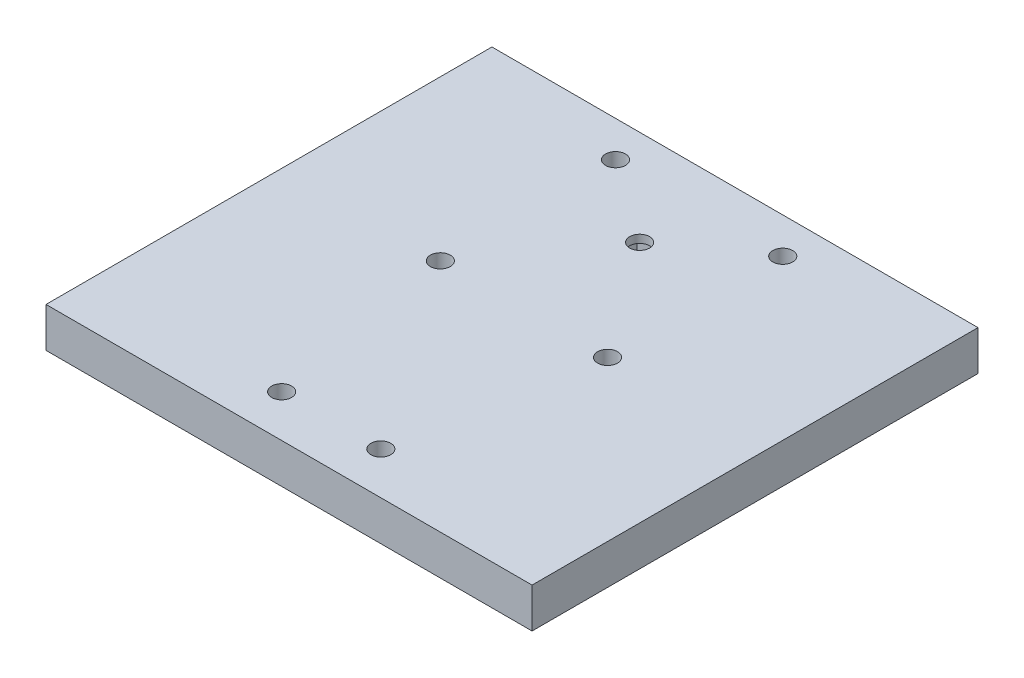
ISO-10303-21;
HEADER;
FILE_DESCRIPTION(('STEP AP214'),'2;1');
FILE_NAME('part.step','',(''),(''),'','','');
FILE_SCHEMA(('AUTOMOTIVE_DESIGN { 1 0 10303 214 1 1 1 1 }'));
ENDSEC;
DATA;
#1=APPLICATION_CONTEXT('core data for automotive mechanical design processes');
#2=APPLICATION_PROTOCOL_DEFINITION('international standard','automotive_design',2000,#1);
#3=PRODUCT_CONTEXT('',#1,'mechanical');
#4=PRODUCT('Part','Part','',(#3));
#5=PRODUCT_RELATED_PRODUCT_CATEGORY('part','',(#4));
#6=PRODUCT_DEFINITION_FORMATION('','',#4);
#7=PRODUCT_DEFINITION_CONTEXT('part definition',#1,'design');
#8=PRODUCT_DEFINITION('design','',#6,#7);
#9=PRODUCT_DEFINITION_SHAPE('','',#8);
#10=(LENGTH_UNIT() NAMED_UNIT(*) SI_UNIT(.MILLI.,.METRE.));
#11=(NAMED_UNIT(*) PLANE_ANGLE_UNIT() SI_UNIT($,.RADIAN.));
#12=(NAMED_UNIT(*) SI_UNIT($,.STERADIAN.) SOLID_ANGLE_UNIT());
#13=UNCERTAINTY_MEASURE_WITH_UNIT(LENGTH_MEASURE(1.E-05),#10,'distance_accuracy_value','');
#14=(GEOMETRIC_REPRESENTATION_CONTEXT(3) GLOBAL_UNCERTAINTY_ASSIGNED_CONTEXT((#13)) GLOBAL_UNIT_ASSIGNED_CONTEXT((#10,
#11,#12)) REPRESENTATION_CONTEXT('',''));
#15=CARTESIAN_POINT('',(0.,0.,0.));
#16=DIRECTION('',(0.,0.,1.));
#17=DIRECTION('',(1.,0.,0.));
#18=AXIS2_PLACEMENT_3D('',#15,#16,#17);
#19=CARTESIAN_POINT('',(0.,0.,0.));
#20=DIRECTION('',(0.,-1.,0.));
#21=DIRECTION('',(0.,0.,-1.));
#22=AXIS2_PLACEMENT_3D('',#19,#20,#21);
#23=PLANE('',#22);
#24=DIRECTION('',(0.,0.,-1.));
#25=VECTOR('',#24,1.);
#26=CARTESIAN_POINT('',(-7.7363993835645,0.,-27.5696885882878));
#27=LINE('',#26,#25);
#28=CARTESIAN_POINT('',(-7.7363993835645,0.,-13.5303114117122));
#29=VERTEX_POINT('',#28);
#30=CARTESIAN_POINT('',(-7.7363993835645,0.,-27.5696885882878));
#31=VERTEX_POINT('',#30);
#32=EDGE_CURVE('E59',#29,#31,#27,.T.);
#33=ORIENTED_EDGE('',*,*,#32,.F.);
#34=DIRECTION('',(-1.,0.,0.));
#35=VECTOR('',#34,1.);
#36=CARTESIAN_POINT('',(7.73639938356448,0.,-13.5303114117122));
#37=LINE('',#36,#35);
#38=CARTESIAN_POINT('',(7.73639938356448,0.,-13.5303114117122));
#39=VERTEX_POINT('',#38);
#40=EDGE_CURVE('E137',#39,#29,#37,.T.);
#41=ORIENTED_EDGE('',*,*,#40,.F.);
#42=DIRECTION('',(0.,0.,1.));
#43=VECTOR('',#42,1.);
#44=CARTESIAN_POINT('',(7.73639938356448,0.,-27.5696885882878));
#45=LINE('',#44,#43);
#46=CARTESIAN_POINT('',(7.73639938356448,0.,-27.5696885882878));
#47=VERTEX_POINT('',#46);
#48=EDGE_CURVE('E140',#47,#39,#45,.T.);
#49=ORIENTED_EDGE('',*,*,#48,.F.);
#50=DIRECTION('',(1.,0.,0.));
#51=VECTOR('',#50,1.);
#52=CARTESIAN_POINT('',(7.73639938356448,0.,-27.5696885882878));
#53=LINE('',#52,#51);
#54=EDGE_CURVE('E149',#31,#47,#53,.T.);
#55=ORIENTED_EDGE('',*,*,#54,.F.);
#56=EDGE_LOOP('',(#33,#41,#49,#55));
#57=FACE_BOUND('',#56,.T.);
#58=CARTESIAN_POINT('',(-12.4499999999998,0.,56.9));
#59=DIRECTION('',(0.,1.,0.));
#60=DIRECTION('',(0.,0.,1.));
#61=AXIS2_PLACEMENT_3D('',#58,#59,#60);
#62=CIRCLE('',#61,2.5);
#63=CARTESIAN_POINT('',(-12.4499999999998,0.,59.4));
#64=VERTEX_POINT('',#63);
#65=EDGE_CURVE('E161',#64,#64,#62,.T.);
#66=ORIENTED_EDGE('',*,*,#65,.T.);
#67=EDGE_LOOP('',(#66));
#68=FACE_BOUND('',#67,.T.);
#69=CARTESIAN_POINT('',(12.4500000000002,0.,56.9));
#70=DIRECTION('',(0.,1.,0.));
#71=DIRECTION('',(0.,0.,1.));
#72=AXIS2_PLACEMENT_3D('',#69,#70,#71);
#73=CIRCLE('',#72,2.5);
#74=CARTESIAN_POINT('',(12.4500000000002,0.,59.4));
#75=VERTEX_POINT('',#74);
#76=EDGE_CURVE('E167',#75,#75,#73,.T.);
#77=ORIENTED_EDGE('',*,*,#76,.T.);
#78=EDGE_LOOP('',(#77));
#79=FACE_BOUND('',#78,.T.);
#80=CARTESIAN_POINT('',(-21.,0.,8.50000000000002));
#81=DIRECTION('',(0.,1.,0.));
#82=DIRECTION('',(0.,0.,1.));
#83=AXIS2_PLACEMENT_3D('',#80,#81,#82);
#84=CIRCLE('',#83,2.5);
#85=CARTESIAN_POINT('',(-21.,0.,11.));
#86=VERTEX_POINT('',#85);
#87=EDGE_CURVE('E173',#86,#86,#84,.T.);
#88=ORIENTED_EDGE('',*,*,#87,.T.);
#89=EDGE_LOOP('',(#88));
#90=FACE_BOUND('',#89,.T.);
#91=CARTESIAN_POINT('',(21.,0.,8.50000000000002));
#92=DIRECTION('',(0.,1.,0.));
#93=DIRECTION('',(0.,0.,1.));
#94=AXIS2_PLACEMENT_3D('',#91,#92,#93);
#95=CIRCLE('',#94,2.5);
#96=CARTESIAN_POINT('',(21.,0.,11.));
#97=VERTEX_POINT('',#96);
#98=EDGE_CURVE('E179',#97,#97,#95,.T.);
#99=ORIENTED_EDGE('',*,*,#98,.T.);
#100=EDGE_LOOP('',(#99));
#101=FACE_BOUND('',#100,.T.);
#102=DIRECTION('',(0.,0.,-1.));
#103=VECTOR('',#102,1.);
#104=CARTESIAN_POINT('',(61.04,0.,-44.5));
#105=LINE('',#104,#103);
#106=CARTESIAN_POINT('',(61.04,0.,67.5));
#107=VERTEX_POINT('',#106);
#108=CARTESIAN_POINT('',(61.04,0.,-44.5));
#109=VERTEX_POINT('',#108);
#110=EDGE_CURVE('E89',#107,#109,#105,.T.);
#111=ORIENTED_EDGE('',*,*,#110,.F.);
#112=DIRECTION('',(1.,0.,0.));
#113=VECTOR('',#112,1.);
#114=CARTESIAN_POINT('',(61.04,0.,67.5));
#115=LINE('',#114,#113);
#116=CARTESIAN_POINT('',(-61.04,0.,67.5));
#117=VERTEX_POINT('',#116);
#118=EDGE_CURVE('E196',#117,#107,#115,.T.);
#119=ORIENTED_EDGE('',*,*,#118,.F.);
#120=DIRECTION('',(0.,0.,1.));
#121=VECTOR('',#120,1.);
#122=CARTESIAN_POINT('',(-61.04,0.,67.5));
#123=LINE('',#122,#121);
#124=CARTESIAN_POINT('',(-61.04,0.,-44.5));
#125=VERTEX_POINT('',#124);
#126=EDGE_CURVE('E206',#125,#117,#123,.T.);
#127=ORIENTED_EDGE('',*,*,#126,.F.);
#128=DIRECTION('',(-1.,0.,0.));
#129=VECTOR('',#128,1.);
#130=CARTESIAN_POINT('',(-61.04,0.,-44.5));
#131=LINE('',#130,#129);
#132=EDGE_CURVE('E203',#109,#125,#131,.T.);
#133=ORIENTED_EDGE('',*,*,#132,.F.);
#134=EDGE_LOOP('',(#111,#119,#127,#133));
#135=FACE_BOUND('',#134,.T.);
#136=CARTESIAN_POINT('',(-21.,0.,-35.5));
#137=DIRECTION('',(0.,1.,0.));
#138=DIRECTION('',(0.,0.,1.));
#139=AXIS2_PLACEMENT_3D('',#136,#137,#138);
#140=CIRCLE('',#139,2.5);
#141=CARTESIAN_POINT('',(-21.,0.,-33.));
#142=VERTEX_POINT('',#141);
#143=EDGE_CURVE('E191',#142,#142,#140,.T.);
#144=ORIENTED_EDGE('',*,*,#143,.T.);
#145=EDGE_LOOP('',(#144));
#146=FACE_BOUND('',#145,.T.);
#147=CARTESIAN_POINT('',(21.,0.,-35.5));
#148=DIRECTION('',(0.,1.,0.));
#149=DIRECTION('',(0.,0.,1.));
#150=AXIS2_PLACEMENT_3D('',#147,#148,#149);
#151=CIRCLE('',#150,2.5);
#152=CARTESIAN_POINT('',(21.,0.,-33.));
#153=VERTEX_POINT('',#152);
#154=EDGE_CURVE('E185',#153,#153,#151,.T.);
#155=ORIENTED_EDGE('',*,*,#154,.T.);
#156=EDGE_LOOP('',(#155));
#157=FACE_BOUND('',#156,.T.);
#158=ADVANCED_FACE('F44',(#57,#68,#79,#90,#101,#135,#146,#157),#23,.T.);
#159=CARTESIAN_POINT('',(61.04,10.,-44.5));
#160=DIRECTION('',(-1.,0.,0.));
#161=DIRECTION('',(0.,0.,1.));
#162=AXIS2_PLACEMENT_3D('',#159,#160,#161);
#163=PLANE('',#162);
#164=ORIENTED_EDGE('',*,*,#110,.T.);
#165=DIRECTION('',(0.,-1.,0.));
#166=VECTOR('',#165,1.);
#167=CARTESIAN_POINT('',(61.04,10.,-44.5));
#168=LINE('',#167,#166);
#169=CARTESIAN_POINT('',(61.04,10.,-44.5));
#170=VERTEX_POINT('',#169);
#171=EDGE_CURVE('E11',#170,#109,#168,.T.);
#172=ORIENTED_EDGE('',*,*,#171,.F.);
#173=DIRECTION('',(0.,0.,-1.));
#174=VECTOR('',#173,1.);
#175=CARTESIAN_POINT('',(61.04,10.,67.5));
#176=LINE('',#175,#174);
#177=CARTESIAN_POINT('',(61.04,10.,67.5));
#178=VERTEX_POINT('',#177);
#179=EDGE_CURVE('E94',#178,#170,#176,.T.);
#180=ORIENTED_EDGE('',*,*,#179,.F.);
#181=DIRECTION('',(0.,-1.,0.));
#182=VECTOR('',#181,1.);
#183=CARTESIAN_POINT('',(61.04,10.,67.5));
#184=LINE('',#183,#182);
#185=EDGE_CURVE('E201',#178,#107,#184,.T.);
#186=ORIENTED_EDGE('',*,*,#185,.T.);
#187=EDGE_LOOP('',(#164,#172,#180,#186));
#188=FACE_BOUND('',#187,.T.);
#189=ADVANCED_FACE('F46',(#188),#163,.F.);
#190=CARTESIAN_POINT('',(-61.04,10.,-44.5));
#191=DIRECTION('',(0.,0.,1.));
#192=DIRECTION('',(1.,0.,0.));
#193=AXIS2_PLACEMENT_3D('',#190,#191,#192);
#194=PLANE('',#193);
#195=ORIENTED_EDGE('',*,*,#132,.T.);
#196=DIRECTION('',(0.,-1.,0.));
#197=VECTOR('',#196,1.);
#198=CARTESIAN_POINT('',(-61.04,10.,-44.5));
#199=LINE('',#198,#197);
#200=CARTESIAN_POINT('',(-61.04,10.,-44.5));
#201=VERTEX_POINT('',#200);
#202=EDGE_CURVE('E52',#201,#125,#199,.T.);
#203=ORIENTED_EDGE('',*,*,#202,.F.);
#204=DIRECTION('',(-1.,0.,0.));
#205=VECTOR('',#204,1.);
#206=CARTESIAN_POINT('',(-61.04,10.,-44.5));
#207=LINE('',#206,#205);
#208=EDGE_CURVE('E195',#170,#201,#207,.T.);
#209=ORIENTED_EDGE('',*,*,#208,.F.);
#210=ORIENTED_EDGE('',*,*,#171,.T.);
#211=EDGE_LOOP('',(#195,#203,#209,#210));
#212=FACE_BOUND('',#211,.T.);
#213=ADVANCED_FACE('F221',(#212),#194,.F.);
#214=CARTESIAN_POINT('',(-61.04,10.,67.5));
#215=DIRECTION('',(1.,0.,0.));
#216=DIRECTION('',(0.,0.,-1.));
#217=AXIS2_PLACEMENT_3D('',#214,#215,#216);
#218=PLANE('',#217);
#219=ORIENTED_EDGE('',*,*,#126,.T.);
#220=DIRECTION('',(0.,-1.,0.));
#221=VECTOR('',#220,1.);
#222=CARTESIAN_POINT('',(-61.04,10.,67.5));
#223=LINE('',#222,#221);
#224=CARTESIAN_POINT('',(-61.04,10.,67.5));
#225=VERTEX_POINT('',#224);
#226=EDGE_CURVE('E211',#225,#117,#223,.T.);
#227=ORIENTED_EDGE('',*,*,#226,.F.);
#228=DIRECTION('',(0.,0.,1.));
#229=VECTOR('',#228,1.);
#230=CARTESIAN_POINT('',(-61.04,10.,-37.5));
#231=LINE('',#230,#229);
#232=EDGE_CURVE('E198',#201,#225,#231,.T.);
#233=ORIENTED_EDGE('',*,*,#232,.F.);
#234=ORIENTED_EDGE('',*,*,#202,.T.);
#235=EDGE_LOOP('',(#219,#227,#233,#234));
#236=FACE_BOUND('',#235,.T.);
#237=ADVANCED_FACE('F217',(#236),#218,.F.);
#238=CARTESIAN_POINT('',(61.04,10.,67.5));
#239=DIRECTION('',(0.,0.,-1.));
#240=DIRECTION('',(-1.,0.,0.));
#241=AXIS2_PLACEMENT_3D('',#238,#239,#240);
#242=PLANE('',#241);
#243=ORIENTED_EDGE('',*,*,#118,.T.);
#244=ORIENTED_EDGE('',*,*,#185,.F.);
#245=DIRECTION('',(1.,0.,0.));
#246=VECTOR('',#245,1.);
#247=CARTESIAN_POINT('',(61.04,10.,67.5));
#248=LINE('',#247,#246);
#249=EDGE_CURVE('E68',#225,#178,#248,.T.);
#250=ORIENTED_EDGE('',*,*,#249,.F.);
#251=ORIENTED_EDGE('',*,*,#226,.T.);
#252=EDGE_LOOP('',(#243,#244,#250,#251));
#253=FACE_BOUND('',#252,.T.);
#254=ADVANCED_FACE('F224',(#253),#242,.F.);
#255=CARTESIAN_POINT('',(0.,10.,0.));
#256=DIRECTION('',(0.,-1.,0.));
#257=DIRECTION('',(0.,0.,-1.));
#258=AXIS2_PLACEMENT_3D('',#255,#256,#257);
#259=PLANE('',#258);
#260=CARTESIAN_POINT('',(0.,9.99999999999999,-20.55));
#261=DIRECTION('',(0.,-1.,0.));
#262=DIRECTION('',(0.,0.,-1.));
#263=AXIS2_PLACEMENT_3D('',#260,#261,#262);
#264=CIRCLE('',#263,2.49999999999999);
#265=CARTESIAN_POINT('',(0.,9.99999999999999,-23.05));
#266=VERTEX_POINT('',#265);
#267=EDGE_CURVE('E528',#266,#266,#264,.T.);
#268=ORIENTED_EDGE('',*,*,#267,.T.);
#269=EDGE_LOOP('',(#268));
#270=FACE_BOUND('',#269,.T.);
#271=CARTESIAN_POINT('',(-12.4499999999998,10.,56.9));
#272=DIRECTION('',(0.,1.,0.));
#273=DIRECTION('',(0.,0.,1.));
#274=AXIS2_PLACEMENT_3D('',#271,#272,#273);
#275=CIRCLE('',#274,2.5);
#276=CARTESIAN_POINT('',(-12.4499999999998,10.,59.4));
#277=VERTEX_POINT('',#276);
#278=EDGE_CURVE('E155',#277,#277,#275,.T.);
#279=ORIENTED_EDGE('',*,*,#278,.F.);
#280=EDGE_LOOP('',(#279));
#281=FACE_BOUND('',#280,.T.);
#282=CARTESIAN_POINT('',(12.4500000000002,10.,56.9));
#283=DIRECTION('',(0.,1.,0.));
#284=DIRECTION('',(0.,0.,1.));
#285=AXIS2_PLACEMENT_3D('',#282,#283,#284);
#286=CIRCLE('',#285,2.5);
#287=CARTESIAN_POINT('',(12.4500000000002,10.,59.4));
#288=VERTEX_POINT('',#287);
#289=EDGE_CURVE('E164',#288,#288,#286,.T.);
#290=ORIENTED_EDGE('',*,*,#289,.F.);
#291=EDGE_LOOP('',(#290));
#292=FACE_BOUND('',#291,.T.);
#293=CARTESIAN_POINT('',(-21.,10.,8.50000000000002));
#294=DIRECTION('',(0.,1.,0.));
#295=DIRECTION('',(0.,0.,1.));
#296=AXIS2_PLACEMENT_3D('',#293,#294,#295);
#297=CIRCLE('',#296,2.5);
#298=CARTESIAN_POINT('',(-21.,10.,11.));
#299=VERTEX_POINT('',#298);
#300=EDGE_CURVE('E170',#299,#299,#297,.T.);
#301=ORIENTED_EDGE('',*,*,#300,.F.);
#302=EDGE_LOOP('',(#301));
#303=FACE_BOUND('',#302,.T.);
#304=CARTESIAN_POINT('',(21.,10.,8.50000000000002));
#305=DIRECTION('',(0.,1.,0.));
#306=DIRECTION('',(0.,0.,1.));
#307=AXIS2_PLACEMENT_3D('',#304,#305,#306);
#308=CIRCLE('',#307,2.5);
#309=CARTESIAN_POINT('',(21.,10.,11.));
#310=VERTEX_POINT('',#309);
#311=EDGE_CURVE('E176',#310,#310,#308,.T.);
#312=ORIENTED_EDGE('',*,*,#311,.F.);
#313=EDGE_LOOP('',(#312));
#314=FACE_BOUND('',#313,.T.);
#315=CARTESIAN_POINT('',(21.,10.,-35.5));
#316=DIRECTION('',(0.,1.,0.));
#317=DIRECTION('',(0.,0.,1.));
#318=AXIS2_PLACEMENT_3D('',#315,#316,#317);
#319=CIRCLE('',#318,2.5);
#320=CARTESIAN_POINT('',(21.,10.,-33.));
#321=VERTEX_POINT('',#320);
#322=EDGE_CURVE('E182',#321,#321,#319,.T.);
#323=ORIENTED_EDGE('',*,*,#322,.F.);
#324=EDGE_LOOP('',(#323));
#325=FACE_BOUND('',#324,.T.);
#326=CARTESIAN_POINT('',(-21.,10.,-35.5));
#327=DIRECTION('',(0.,1.,0.));
#328=DIRECTION('',(0.,0.,1.));
#329=AXIS2_PLACEMENT_3D('',#326,#327,#328);
#330=CIRCLE('',#329,2.5);
#331=CARTESIAN_POINT('',(-21.,10.,-33.));
#332=VERTEX_POINT('',#331);
#333=EDGE_CURVE('E188',#332,#332,#330,.T.);
#334=ORIENTED_EDGE('',*,*,#333,.F.);
#335=EDGE_LOOP('',(#334));
#336=FACE_BOUND('',#335,.T.);
#337=ORIENTED_EDGE('',*,*,#179,.T.);
#338=ORIENTED_EDGE('',*,*,#208,.T.);
#339=ORIENTED_EDGE('',*,*,#232,.T.);
#340=ORIENTED_EDGE('',*,*,#249,.T.);
#341=EDGE_LOOP('',(#337,#338,#339,#340));
#342=FACE_BOUND('',#341,.T.);
#343=ADVANCED_FACE('F238',(#270,#281,#292,#303,#314,#325,#336,#342),#259,.F.);
#344=CARTESIAN_POINT('',(-21.,10.,-35.5));
#345=DIRECTION('',(0.,1.,0.));
#346=DIRECTION('',(0.,0.,1.));
#347=AXIS2_PLACEMENT_3D('',#344,#345,#346);
#348=CYLINDRICAL_SURFACE('',#347,2.5);
#349=ORIENTED_EDGE('',*,*,#143,.F.);
#350=EDGE_LOOP('',(#349));
#351=FACE_BOUND('',#350,.T.);
#352=ORIENTED_EDGE('',*,*,#333,.T.);
#353=EDGE_LOOP('',(#352));
#354=FACE_BOUND('',#353,.T.);
#355=ADVANCED_FACE('F257',(#351,#354),#348,.F.);
#356=CARTESIAN_POINT('',(21.,10.,-35.5));
#357=DIRECTION('',(0.,1.,0.));
#358=DIRECTION('',(0.,0.,1.));
#359=AXIS2_PLACEMENT_3D('',#356,#357,#358);
#360=CYLINDRICAL_SURFACE('',#359,2.5);
#361=ORIENTED_EDGE('',*,*,#154,.F.);
#362=EDGE_LOOP('',(#361));
#363=FACE_BOUND('',#362,.T.);
#364=ORIENTED_EDGE('',*,*,#322,.T.);
#365=EDGE_LOOP('',(#364));
#366=FACE_BOUND('',#365,.T.);
#367=ADVANCED_FACE('F264',(#363,#366),#360,.F.);
#368=CARTESIAN_POINT('',(21.,10.,8.50000000000002));
#369=DIRECTION('',(0.,1.,0.));
#370=DIRECTION('',(0.,0.,1.));
#371=AXIS2_PLACEMENT_3D('',#368,#369,#370);
#372=CYLINDRICAL_SURFACE('',#371,2.5);
#373=ORIENTED_EDGE('',*,*,#98,.F.);
#374=EDGE_LOOP('',(#373));
#375=FACE_BOUND('',#374,.T.);
#376=ORIENTED_EDGE('',*,*,#311,.T.);
#377=EDGE_LOOP('',(#376));
#378=FACE_BOUND('',#377,.T.);
#379=ADVANCED_FACE('F271',(#375,#378),#372,.F.);
#380=CARTESIAN_POINT('',(-21.,10.,8.50000000000002));
#381=DIRECTION('',(0.,1.,0.));
#382=DIRECTION('',(0.,0.,1.));
#383=AXIS2_PLACEMENT_3D('',#380,#381,#382);
#384=CYLINDRICAL_SURFACE('',#383,2.5);
#385=ORIENTED_EDGE('',*,*,#87,.F.);
#386=EDGE_LOOP('',(#385));
#387=FACE_BOUND('',#386,.T.);
#388=ORIENTED_EDGE('',*,*,#300,.T.);
#389=EDGE_LOOP('',(#388));
#390=FACE_BOUND('',#389,.T.);
#391=ADVANCED_FACE('F279',(#387,#390),#384,.F.);
#392=CARTESIAN_POINT('',(12.4500000000002,10.,56.9));
#393=DIRECTION('',(0.,1.,0.));
#394=DIRECTION('',(0.,0.,1.));
#395=AXIS2_PLACEMENT_3D('',#392,#393,#394);
#396=CYLINDRICAL_SURFACE('',#395,2.5);
#397=ORIENTED_EDGE('',*,*,#76,.F.);
#398=EDGE_LOOP('',(#397));
#399=FACE_BOUND('',#398,.T.);
#400=ORIENTED_EDGE('',*,*,#289,.T.);
#401=EDGE_LOOP('',(#400));
#402=FACE_BOUND('',#401,.T.);
#403=ADVANCED_FACE('F287',(#399,#402),#396,.F.);
#404=CARTESIAN_POINT('',(-12.4499999999998,10.,56.9));
#405=DIRECTION('',(0.,1.,0.));
#406=DIRECTION('',(0.,0.,1.));
#407=AXIS2_PLACEMENT_3D('',#404,#405,#406);
#408=CYLINDRICAL_SURFACE('',#407,2.5);
#409=ORIENTED_EDGE('',*,*,#65,.F.);
#410=EDGE_LOOP('',(#409));
#411=FACE_BOUND('',#410,.T.);
#412=ORIENTED_EDGE('',*,*,#278,.T.);
#413=EDGE_LOOP('',(#412));
#414=FACE_BOUND('',#413,.T.);
#415=ADVANCED_FACE('F295',(#411,#414),#408,.F.);
#416=CARTESIAN_POINT('',(-7.7363993835645,8.,-27.5696885882878));
#417=DIRECTION('',(-1.,0.,0.));
#418=DIRECTION('',(0.,0.,1.));
#419=AXIS2_PLACEMENT_3D('',#416,#417,#418);
#420=PLANE('',#419);
#421=ORIENTED_EDGE('',*,*,#32,.T.);
#422=DIRECTION('',(0.,-1.,0.));
#423=VECTOR('',#422,1.);
#424=CARTESIAN_POINT('',(-7.7363993835645,8.,-27.5696885882878));
#425=LINE('',#424,#423);
#426=CARTESIAN_POINT('',(-7.7363993835645,8.,-27.5696885882878));
#427=VERTEX_POINT('',#426);
#428=EDGE_CURVE('E115',#427,#31,#425,.T.);
#429=ORIENTED_EDGE('',*,*,#428,.F.);
#430=DIRECTION('',(0.,0.,-1.));
#431=VECTOR('',#430,1.);
#432=CARTESIAN_POINT('',(-7.7363993835645,8.,-27.5696885882878));
#433=LINE('',#432,#431);
#434=CARTESIAN_POINT('',(-7.7363993835645,8.,-13.5303114117122));
#435=VERTEX_POINT('',#434);
#436=EDGE_CURVE('E119',#435,#427,#433,.T.);
#437=ORIENTED_EDGE('',*,*,#436,.F.);
#438=DIRECTION('',(0.,-1.,0.));
#439=VECTOR('',#438,1.);
#440=CARTESIAN_POINT('',(-7.7363993835645,8.,-13.5303114117122));
#441=LINE('',#440,#439);
#442=EDGE_CURVE('E153',#435,#29,#441,.T.);
#443=ORIENTED_EDGE('',*,*,#442,.T.);
#444=EDGE_LOOP('',(#421,#429,#437,#443));
#445=FACE_BOUND('',#444,.T.);
#446=ADVANCED_FACE('F117',(#445),#420,.F.);
#447=CARTESIAN_POINT('',(7.73639938356448,8.,-13.5303114117122));
#448=DIRECTION('',(0.,0.,1.));
#449=DIRECTION('',(1.,0.,0.));
#450=AXIS2_PLACEMENT_3D('',#447,#448,#449);
#451=PLANE('',#450);
#452=ORIENTED_EDGE('',*,*,#40,.T.);
#453=ORIENTED_EDGE('',*,*,#442,.F.);
#454=DIRECTION('',(-1.,0.,0.));
#455=VECTOR('',#454,1.);
#456=CARTESIAN_POINT('',(7.73639938356448,8.,-13.5303114117122));
#457=LINE('',#456,#455);
#458=CARTESIAN_POINT('',(7.73639938356448,8.,-13.5303114117122));
#459=VERTEX_POINT('',#458);
#460=EDGE_CURVE('E125',#459,#435,#457,.T.);
#461=ORIENTED_EDGE('',*,*,#460,.F.);
#462=DIRECTION('',(0.,-1.,0.));
#463=VECTOR('',#462,1.);
#464=CARTESIAN_POINT('',(7.73639938356448,8.,-13.5303114117122));
#465=LINE('',#464,#463);
#466=EDGE_CURVE('E156',#459,#39,#465,.T.);
#467=ORIENTED_EDGE('',*,*,#466,.T.);
#468=EDGE_LOOP('',(#452,#453,#461,#467));
#469=FACE_BOUND('',#468,.T.);
#470=ADVANCED_FACE('F310',(#469),#451,.F.);
#471=CARTESIAN_POINT('',(7.73639938356448,8.,-27.5696885882878));
#472=DIRECTION('',(1.,0.,0.));
#473=DIRECTION('',(0.,0.,-1.));
#474=AXIS2_PLACEMENT_3D('',#471,#472,#473);
#475=PLANE('',#474);
#476=ORIENTED_EDGE('',*,*,#48,.T.);
#477=ORIENTED_EDGE('',*,*,#466,.F.);
#478=DIRECTION('',(0.,0.,1.));
#479=VECTOR('',#478,1.);
#480=CARTESIAN_POINT('',(7.73639938356448,8.,-27.5696885882878));
#481=LINE('',#480,#479);
#482=CARTESIAN_POINT('',(7.73639938356448,8.,-27.5696885882878));
#483=VERTEX_POINT('',#482);
#484=EDGE_CURVE('E133',#483,#459,#481,.T.);
#485=ORIENTED_EDGE('',*,*,#484,.F.);
#486=DIRECTION('',(0.,-1.,0.));
#487=VECTOR('',#486,1.);
#488=CARTESIAN_POINT('',(7.73639938356448,8.,-27.5696885882878));
#489=LINE('',#488,#487);
#490=EDGE_CURVE('E124',#483,#47,#489,.T.);
#491=ORIENTED_EDGE('',*,*,#490,.T.);
#492=EDGE_LOOP('',(#476,#477,#485,#491));
#493=FACE_BOUND('',#492,.T.);
#494=ADVANCED_FACE('F317',(#493),#475,.F.);
#495=CARTESIAN_POINT('',(7.73639938356448,8.,-27.5696885882878));
#496=DIRECTION('',(0.,0.,-1.));
#497=DIRECTION('',(-1.,0.,0.));
#498=AXIS2_PLACEMENT_3D('',#495,#496,#497);
#499=PLANE('',#498);
#500=ORIENTED_EDGE('',*,*,#54,.T.);
#501=ORIENTED_EDGE('',*,*,#490,.F.);
#502=DIRECTION('',(1.,0.,0.));
#503=VECTOR('',#502,1.);
#504=CARTESIAN_POINT('',(7.73639938356448,8.,-27.5696885882878));
#505=LINE('',#504,#503);
#506=EDGE_CURVE('E128',#427,#483,#505,.T.);
#507=ORIENTED_EDGE('',*,*,#506,.F.);
#508=ORIENTED_EDGE('',*,*,#428,.T.);
#509=EDGE_LOOP('',(#500,#501,#507,#508));
#510=FACE_BOUND('',#509,.T.);
#511=ADVANCED_FACE('F129',(#510),#499,.F.);
#512=CARTESIAN_POINT('',(0.,8.,0.));
#513=DIRECTION('',(0.,-1.,0.));
#514=DIRECTION('',(0.,0.,-1.));
#515=AXIS2_PLACEMENT_3D('',#512,#513,#514);
#516=PLANE('',#515);
#517=CARTESIAN_POINT('',(0.,8.,-20.55));
#518=DIRECTION('',(0.,-1.,0.));
#519=DIRECTION('',(0.,0.,-1.));
#520=AXIS2_PLACEMENT_3D('',#517,#518,#519);
#521=CIRCLE('',#520,2.49999999999999);
#522=CARTESIAN_POINT('',(0.,8.,-23.05));
#523=VERTEX_POINT('',#522);
#524=EDGE_CURVE('E143',#523,#523,#521,.T.);
#525=ORIENTED_EDGE('',*,*,#524,.F.);
#526=EDGE_LOOP('',(#525));
#527=FACE_BOUND('',#526,.T.);
#528=ORIENTED_EDGE('',*,*,#436,.T.);
#529=ORIENTED_EDGE('',*,*,#506,.T.);
#530=ORIENTED_EDGE('',*,*,#484,.T.);
#531=ORIENTED_EDGE('',*,*,#460,.T.);
#532=EDGE_LOOP('',(#528,#529,#530,#531));
#533=FACE_BOUND('',#532,.T.);
#534=ADVANCED_FACE('F135',(#527,#533),#516,.T.);
#535=CARTESIAN_POINT('',(0.,0.,-20.55));
#536=DIRECTION('',(0.,-1.,0.));
#537=DIRECTION('',(0.,0.,-1.));
#538=AXIS2_PLACEMENT_3D('',#535,#536,#537);
#539=CYLINDRICAL_SURFACE('',#538,2.49999999999999);
#540=ORIENTED_EDGE('',*,*,#524,.T.);
#541=EDGE_LOOP('',(#540));
#542=FACE_BOUND('',#541,.T.);
#543=ORIENTED_EDGE('',*,*,#267,.F.);
#544=EDGE_LOOP('',(#543));
#545=FACE_BOUND('',#544,.T.);
#546=ADVANCED_FACE('F338',(#542,#545),#539,.F.);
#547=CLOSED_SHELL('',(#158,#189,#213,#237,#254,#343,#355,#367,#379,#391,#403,#415,#446,#470,
#494,#511,#534,#546));
#548=MANIFOLD_SOLID_BREP('B2',#547);
#549=ADVANCED_BREP_SHAPE_REPRESENTATION('',(#18,#548),#14);
#550=SHAPE_DEFINITION_REPRESENTATION(#9,#549);
ENDSEC;
END-ISO-10303-21;
